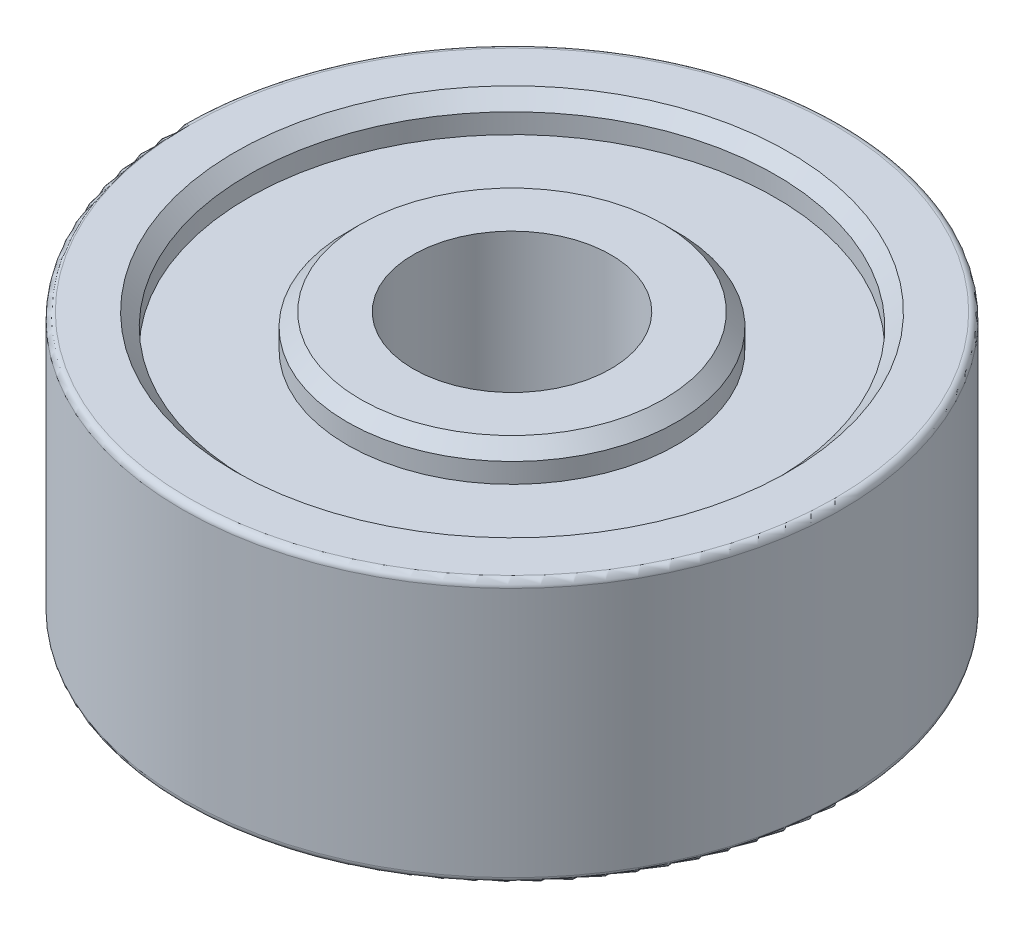
ISO-10303-21;
HEADER;
FILE_DESCRIPTION(('STEP AP214'),'2;1');
FILE_NAME('part.step','',(''),(''),'','','');
FILE_SCHEMA(('AUTOMOTIVE_DESIGN { 1 0 10303 214 1 1 1 1 }'));
ENDSEC;
DATA;
#1=APPLICATION_CONTEXT('core data for automotive mechanical design processes');
#2=APPLICATION_PROTOCOL_DEFINITION('international standard','automotive_design',2000,#1);
#3=PRODUCT_CONTEXT('',#1,'mechanical');
#4=PRODUCT('Part','Part','',(#3));
#5=PRODUCT_RELATED_PRODUCT_CATEGORY('part','',(#4));
#6=PRODUCT_DEFINITION_FORMATION('','',#4);
#7=PRODUCT_DEFINITION_CONTEXT('part definition',#1,'design');
#8=PRODUCT_DEFINITION('design','',#6,#7);
#9=PRODUCT_DEFINITION_SHAPE('','',#8);
#10=(LENGTH_UNIT() NAMED_UNIT(*) SI_UNIT(.MILLI.,.METRE.));
#11=(NAMED_UNIT(*) PLANE_ANGLE_UNIT() SI_UNIT($,.RADIAN.));
#12=(NAMED_UNIT(*) SI_UNIT($,.STERADIAN.) SOLID_ANGLE_UNIT());
#13=UNCERTAINTY_MEASURE_WITH_UNIT(LENGTH_MEASURE(1.E-05),#10,'distance_accuracy_value','');
#14=(GEOMETRIC_REPRESENTATION_CONTEXT(3) GLOBAL_UNCERTAINTY_ASSIGNED_CONTEXT((#13)) GLOBAL_UNIT_ASSIGNED_CONTEXT((#10,
#11,#12)) REPRESENTATION_CONTEXT('',''));
#15=CARTESIAN_POINT('',(0.,0.,0.));
#16=DIRECTION('',(0.,0.,1.));
#17=DIRECTION('',(1.,0.,0.));
#18=AXIS2_PLACEMENT_3D('',#15,#16,#17);
#19=CARTESIAN_POINT('',(0.,-2.,0.));
#20=DIRECTION('',(0.,1.,0.));
#21=DIRECTION('',(0.,0.,1.));
#22=AXIS2_PLACEMENT_3D('',#19,#20,#21);
#23=PLANE('',#22);
#24=CARTESIAN_POINT('',(0.,-2.,0.));
#25=DIRECTION('',(0.,1.,0.));
#26=DIRECTION('',(0.,0.,1.));
#27=AXIS2_PLACEMENT_3D('',#24,#25,#26);
#28=CIRCLE('',#27,2.3);
#29=CARTESIAN_POINT('',(0.,-2.,2.3));
#30=VERTEX_POINT('',#29);
#31=EDGE_CURVE('E65',#30,#30,#28,.F.);
#32=ORIENTED_EDGE('',*,*,#31,.T.);
#33=EDGE_LOOP('',(#32));
#34=FACE_BOUND('',#33,.T.);
#35=CARTESIAN_POINT('',(0.,-2.,0.));
#36=DIRECTION('',(0.,1.,0.));
#37=DIRECTION('',(0.,0.,1.));
#38=AXIS2_PLACEMENT_3D('',#35,#36,#37);
#39=CIRCLE('',#38,1.5);
#40=CARTESIAN_POINT('',(0.,-2.,1.5));
#41=VERTEX_POINT('',#40);
#42=EDGE_CURVE('E78',#41,#41,#39,.T.);
#43=ORIENTED_EDGE('',*,*,#42,.T.);
#44=EDGE_LOOP('',(#43));
#45=FACE_BOUND('',#44,.T.);
#46=ADVANCED_FACE('F33',(#34,#45),#23,.F.);
#47=CARTESIAN_POINT('',(0.,2.,0.));
#48=DIRECTION('',(0.,1.,0.));
#49=DIRECTION('',(0.,0.,1.));
#50=AXIS2_PLACEMENT_3D('',#47,#48,#49);
#51=PLANE('',#50);
#52=CARTESIAN_POINT('',(0.,2.,0.));
#53=DIRECTION('',(0.,1.,0.));
#54=DIRECTION('',(0.,0.,1.));
#55=AXIS2_PLACEMENT_3D('',#52,#53,#54);
#56=CIRCLE('',#55,2.3);
#57=CARTESIAN_POINT('',(0.,2.,2.3));
#58=VERTEX_POINT('',#57);
#59=EDGE_CURVE('E62',#58,#58,#56,.T.);
#60=ORIENTED_EDGE('',*,*,#59,.T.);
#61=EDGE_LOOP('',(#60));
#62=FACE_BOUND('',#61,.T.);
#63=CARTESIAN_POINT('',(0.,2.,0.));
#64=DIRECTION('',(0.,1.,0.));
#65=DIRECTION('',(0.,0.,1.));
#66=AXIS2_PLACEMENT_3D('',#63,#64,#65);
#67=CIRCLE('',#66,1.5);
#68=CARTESIAN_POINT('',(0.,2.,1.5));
#69=VERTEX_POINT('',#68);
#70=EDGE_CURVE('E77',#69,#69,#67,.T.);
#71=ORIENTED_EDGE('',*,*,#70,.F.);
#72=EDGE_LOOP('',(#71));
#73=FACE_BOUND('',#72,.T.);
#74=ADVANCED_FACE('F115',(#62,#73),#51,.T.);
#75=CARTESIAN_POINT('',(0.,2.,0.));
#76=DIRECTION('',(0.,1.,0.));
#77=DIRECTION('',(0.,0.,1.));
#78=AXIS2_PLACEMENT_3D('',#75,#76,#77);
#79=CIRCLE('',#78,4.9);
#80=CARTESIAN_POINT('',(0.,2.,4.9));
#81=VERTEX_POINT('',#80);
#82=EDGE_CURVE('E10',#81,#81,#79,.T.);
#83=ORIENTED_EDGE('',*,*,#82,.T.);
#84=EDGE_LOOP('',(#83));
#85=FACE_BOUND('',#84,.T.);
#86=CARTESIAN_POINT('',(0.,2.,0.));
#87=DIRECTION('',(0.,1.,0.));
#88=DIRECTION('',(0.,0.,1.));
#89=AXIS2_PLACEMENT_3D('',#86,#87,#88);
#90=CIRCLE('',#89,4.2);
#91=CARTESIAN_POINT('',(0.,2.,4.2));
#92=VERTEX_POINT('',#91);
#93=EDGE_CURVE('E53',#92,#92,#90,.F.);
#94=ORIENTED_EDGE('',*,*,#93,.T.);
#95=EDGE_LOOP('',(#94));
#96=FACE_BOUND('',#95,.T.);
#97=ADVANCED_FACE('F122',(#85,#96),#51,.T.);
#98=CARTESIAN_POINT('',(0.,-2.,0.));
#99=DIRECTION('',(0.,1.,0.));
#100=DIRECTION('',(0.,0.,1.));
#101=AXIS2_PLACEMENT_3D('',#98,#99,#100);
#102=CIRCLE('',#101,4.9);
#103=CARTESIAN_POINT('',(0.,-2.,4.9));
#104=VERTEX_POINT('',#103);
#105=EDGE_CURVE('E40',#104,#104,#102,.F.);
#106=ORIENTED_EDGE('',*,*,#105,.T.);
#107=EDGE_LOOP('',(#106));
#108=FACE_BOUND('',#107,.T.);
#109=CARTESIAN_POINT('',(0.,-2.,0.));
#110=DIRECTION('',(0.,1.,0.));
#111=DIRECTION('',(0.,0.,1.));
#112=AXIS2_PLACEMENT_3D('',#109,#110,#111);
#113=CIRCLE('',#112,4.2);
#114=CARTESIAN_POINT('',(0.,-2.,4.2));
#115=VERTEX_POINT('',#114);
#116=EDGE_CURVE('E74',#115,#115,#113,.T.);
#117=ORIENTED_EDGE('',*,*,#116,.T.);
#118=EDGE_LOOP('',(#117));
#119=FACE_BOUND('',#118,.T.);
#120=ADVANCED_FACE('F118',(#108,#119),#23,.F.);
#121=CARTESIAN_POINT('',(0.,2.,0.));
#122=DIRECTION('',(0.,-1.,0.));
#123=DIRECTION('',(0.,0.,-1.));
#124=AXIS2_PLACEMENT_3D('',#121,#122,#123);
#125=CYLINDRICAL_SURFACE('',#124,5.);
#126=CARTESIAN_POINT('',(0.,-1.9,0.));
#127=DIRECTION('',(0.,1.,0.));
#128=DIRECTION('',(0.,0.,1.));
#129=AXIS2_PLACEMENT_3D('',#126,#127,#128);
#130=CIRCLE('',#129,5.);
#131=CARTESIAN_POINT('',(0.,-1.9,5.));
#132=VERTEX_POINT('',#131);
#133=EDGE_CURVE('E44',#132,#132,#130,.T.);
#134=ORIENTED_EDGE('',*,*,#133,.T.);
#135=EDGE_LOOP('',(#134));
#136=FACE_BOUND('',#135,.T.);
#137=CARTESIAN_POINT('',(0.,1.9,0.));
#138=DIRECTION('',(0.,1.,0.));
#139=DIRECTION('',(0.,0.,1.));
#140=AXIS2_PLACEMENT_3D('',#137,#138,#139);
#141=CIRCLE('',#140,5.);
#142=CARTESIAN_POINT('',(0.,1.9,5.));
#143=VERTEX_POINT('',#142);
#144=EDGE_CURVE('E48',#143,#143,#141,.F.);
#145=ORIENTED_EDGE('',*,*,#144,.T.);
#146=EDGE_LOOP('',(#145));
#147=FACE_BOUND('',#146,.T.);
#148=ADVANCED_FACE('F128',(#136,#147),#125,.T.);
#149=CARTESIAN_POINT('',(0.,2.,0.));
#150=DIRECTION('',(0.,-1.,0.));
#151=DIRECTION('',(0.,0.,-1.));
#152=AXIS2_PLACEMENT_3D('',#149,#150,#151);
#153=CYLINDRICAL_SURFACE('',#152,1.5);
#154=ORIENTED_EDGE('',*,*,#70,.T.);
#155=EDGE_LOOP('',(#154));
#156=FACE_BOUND('',#155,.T.);
#157=ORIENTED_EDGE('',*,*,#42,.F.);
#158=EDGE_LOOP('',(#157));
#159=FACE_BOUND('',#158,.T.);
#160=ADVANCED_FACE('F133',(#156,#159),#153,.F.);
#161=CARTESIAN_POINT('',(0.,1.5,0.));
#162=DIRECTION('',(0.,1.,0.));
#163=DIRECTION('',(0.,0.,1.));
#164=AXIS2_PLACEMENT_3D('',#161,#162,#163);
#165=CYLINDRICAL_SURFACE('',#164,4.);
#166=CARTESIAN_POINT('',(0.,1.8,0.));
#167=DIRECTION('',(0.,1.,0.));
#168=DIRECTION('',(0.,0.,1.));
#169=AXIS2_PLACEMENT_3D('',#166,#167,#168);
#170=CIRCLE('',#169,4.);
#171=CARTESIAN_POINT('',(0.,1.8,4.));
#172=VERTEX_POINT('',#171);
#173=EDGE_CURVE('E56',#172,#172,#170,.T.);
#174=ORIENTED_EDGE('',*,*,#173,.T.);
#175=EDGE_LOOP('',(#174));
#176=FACE_BOUND('',#175,.T.);
#177=CARTESIAN_POINT('',(0.,1.5,0.));
#178=DIRECTION('',(0.,1.,0.));
#179=DIRECTION('',(0.,0.,1.));
#180=AXIS2_PLACEMENT_3D('',#177,#178,#179);
#181=CIRCLE('',#180,4.);
#182=CARTESIAN_POINT('',(0.,1.5,4.));
#183=VERTEX_POINT('',#182);
#184=EDGE_CURVE('E81',#183,#183,#181,.T.);
#185=ORIENTED_EDGE('',*,*,#184,.F.);
#186=EDGE_LOOP('',(#185));
#187=FACE_BOUND('',#186,.T.);
#188=ADVANCED_FACE('F144',(#176,#187),#165,.F.);
#189=CARTESIAN_POINT('',(0.,1.5,0.));
#190=DIRECTION('',(0.,1.,0.));
#191=DIRECTION('',(0.,0.,1.));
#192=AXIS2_PLACEMENT_3D('',#189,#190,#191);
#193=PLANE('',#192);
#194=CARTESIAN_POINT('',(0.,1.5,0.));
#195=DIRECTION('',(0.,1.,0.));
#196=DIRECTION('',(0.,0.,1.));
#197=AXIS2_PLACEMENT_3D('',#194,#195,#196);
#198=CIRCLE('',#197,2.5);
#199=CARTESIAN_POINT('',(0.,1.5,2.5));
#200=VERTEX_POINT('',#199);
#201=EDGE_CURVE('E86',#200,#200,#198,.T.);
#202=ORIENTED_EDGE('',*,*,#201,.F.);
#203=EDGE_LOOP('',(#202));
#204=FACE_BOUND('',#203,.T.);
#205=ORIENTED_EDGE('',*,*,#184,.T.);
#206=EDGE_LOOP('',(#205));
#207=FACE_BOUND('',#206,.T.);
#208=ADVANCED_FACE('F148',(#204,#207),#193,.T.);
#209=CARTESIAN_POINT('',(0.,1.5,0.));
#210=DIRECTION('',(0.,1.,0.));
#211=DIRECTION('',(0.,0.,1.));
#212=AXIS2_PLACEMENT_3D('',#209,#210,#211);
#213=CYLINDRICAL_SURFACE('',#212,2.5);
#214=CARTESIAN_POINT('',(0.,1.8,0.));
#215=DIRECTION('',(0.,1.,0.));
#216=DIRECTION('',(0.,0.,1.));
#217=AXIS2_PLACEMENT_3D('',#214,#215,#216);
#218=CIRCLE('',#217,2.5);
#219=CARTESIAN_POINT('',(0.,1.8,2.5));
#220=VERTEX_POINT('',#219);
#221=EDGE_CURVE('E59',#220,#220,#218,.F.);
#222=ORIENTED_EDGE('',*,*,#221,.T.);
#223=EDGE_LOOP('',(#222));
#224=FACE_BOUND('',#223,.T.);
#225=ORIENTED_EDGE('',*,*,#201,.T.);
#226=EDGE_LOOP('',(#225));
#227=FACE_BOUND('',#226,.T.);
#228=ADVANCED_FACE('F152',(#224,#227),#213,.T.);
#229=CARTESIAN_POINT('',(0.,-1.5,0.));
#230=DIRECTION('',(0.,-1.,0.));
#231=DIRECTION('',(0.,0.,1.));
#232=AXIS2_PLACEMENT_3D('',#229,#230,#231);
#233=PLANE('',#232);
#234=CARTESIAN_POINT('',(0.,-1.5,0.));
#235=DIRECTION('',(0.,1.,0.));
#236=DIRECTION('',(0.,0.,1.));
#237=AXIS2_PLACEMENT_3D('',#234,#235,#236);
#238=CIRCLE('',#237,4.);
#239=CARTESIAN_POINT('',(0.,-1.5,4.));
#240=VERTEX_POINT('',#239);
#241=EDGE_CURVE('E89',#240,#240,#238,.T.);
#242=ORIENTED_EDGE('',*,*,#241,.F.);
#243=EDGE_LOOP('',(#242));
#244=FACE_BOUND('',#243,.T.);
#245=CARTESIAN_POINT('',(0.,-1.5,0.));
#246=DIRECTION('',(0.,1.,0.));
#247=DIRECTION('',(0.,0.,1.));
#248=AXIS2_PLACEMENT_3D('',#245,#246,#247);
#249=CIRCLE('',#248,2.5);
#250=CARTESIAN_POINT('',(0.,-1.5,2.5));
#251=VERTEX_POINT('',#250);
#252=EDGE_CURVE('E92',#251,#251,#249,.T.);
#253=ORIENTED_EDGE('',*,*,#252,.T.);
#254=EDGE_LOOP('',(#253));
#255=FACE_BOUND('',#254,.T.);
#256=ADVANCED_FACE('F96',(#244,#255),#233,.T.);
#257=CARTESIAN_POINT('',(0.,-1.5,0.));
#258=DIRECTION('',(0.,-1.,0.));
#259=DIRECTION('',(0.,0.,-1.));
#260=AXIS2_PLACEMENT_3D('',#257,#258,#259);
#261=CYLINDRICAL_SURFACE('',#260,4.);
#262=CARTESIAN_POINT('',(0.,-1.8,0.));
#263=DIRECTION('',(0.,1.,0.));
#264=DIRECTION('',(0.,0.,1.));
#265=AXIS2_PLACEMENT_3D('',#262,#263,#264);
#266=CIRCLE('',#265,4.);
#267=CARTESIAN_POINT('',(0.,-1.8,4.));
#268=VERTEX_POINT('',#267);
#269=EDGE_CURVE('E71',#268,#268,#266,.F.);
#270=ORIENTED_EDGE('',*,*,#269,.T.);
#271=EDGE_LOOP('',(#270));
#272=FACE_BOUND('',#271,.T.);
#273=ORIENTED_EDGE('',*,*,#241,.T.);
#274=EDGE_LOOP('',(#273));
#275=FACE_BOUND('',#274,.T.);
#276=ADVANCED_FACE('F101',(#272,#275),#261,.F.);
#277=CARTESIAN_POINT('',(0.,-1.5,0.));
#278=DIRECTION('',(0.,-1.,0.));
#279=DIRECTION('',(0.,0.,-1.));
#280=AXIS2_PLACEMENT_3D('',#277,#278,#279);
#281=CYLINDRICAL_SURFACE('',#280,2.5);
#282=CARTESIAN_POINT('',(0.,-1.8,0.));
#283=DIRECTION('',(0.,1.,0.));
#284=DIRECTION('',(0.,0.,1.));
#285=AXIS2_PLACEMENT_3D('',#282,#283,#284);
#286=CIRCLE('',#285,2.5);
#287=CARTESIAN_POINT('',(0.,-1.8,2.5));
#288=VERTEX_POINT('',#287);
#289=EDGE_CURVE('E68',#288,#288,#286,.T.);
#290=ORIENTED_EDGE('',*,*,#289,.T.);
#291=EDGE_LOOP('',(#290));
#292=FACE_BOUND('',#291,.T.);
#293=ORIENTED_EDGE('',*,*,#252,.F.);
#294=EDGE_LOOP('',(#293));
#295=FACE_BOUND('',#294,.T.);
#296=ADVANCED_FACE('F98',(#292,#295),#281,.T.);
#297=CARTESIAN_POINT('',(0.,-2.,0.));
#298=DIRECTION('',(0.,-1.,0.));
#299=DIRECTION('',(0.,0.,-1.));
#300=AXIS2_PLACEMENT_3D('',#297,#298,#299);
#301=CONICAL_SURFACE('',#300,4.2,0.785398163397442);
#302=ORIENTED_EDGE('',*,*,#269,.F.);
#303=EDGE_LOOP('',(#302));
#304=FACE_BOUND('',#303,.T.);
#305=ORIENTED_EDGE('',*,*,#116,.F.);
#306=EDGE_LOOP('',(#305));
#307=FACE_BOUND('',#306,.T.);
#308=ADVANCED_FACE('F100',(#304,#307),#301,.F.);
#309=CARTESIAN_POINT('',(0.,-1.8,0.));
#310=DIRECTION('',(0.,1.,0.));
#311=DIRECTION('',(0.,0.,1.));
#312=AXIS2_PLACEMENT_3D('',#309,#310,#311);
#313=CONICAL_SURFACE('',#312,2.5,0.785398163397451);
#314=ORIENTED_EDGE('',*,*,#31,.F.);
#315=EDGE_LOOP('',(#314));
#316=FACE_BOUND('',#315,.T.);
#317=ORIENTED_EDGE('',*,*,#289,.F.);
#318=EDGE_LOOP('',(#317));
#319=FACE_BOUND('',#318,.T.);
#320=ADVANCED_FACE('F108',(#316,#319),#313,.T.);
#321=CARTESIAN_POINT('',(0.,2.,0.));
#322=DIRECTION('',(0.,-1.,0.));
#323=DIRECTION('',(0.,0.,-1.));
#324=AXIS2_PLACEMENT_3D('',#321,#322,#323);
#325=CONICAL_SURFACE('',#324,2.3,0.785398163397445);
#326=ORIENTED_EDGE('',*,*,#221,.F.);
#327=EDGE_LOOP('',(#326));
#328=FACE_BOUND('',#327,.T.);
#329=ORIENTED_EDGE('',*,*,#59,.F.);
#330=EDGE_LOOP('',(#329));
#331=FACE_BOUND('',#330,.T.);
#332=ADVANCED_FACE('F191',(#328,#331),#325,.T.);
#333=CARTESIAN_POINT('',(0.,1.8,0.));
#334=DIRECTION('',(0.,1.,0.));
#335=DIRECTION('',(0.,0.,1.));
#336=AXIS2_PLACEMENT_3D('',#333,#334,#335);
#337=CONICAL_SURFACE('',#336,4.,0.78539816339745);
#338=ORIENTED_EDGE('',*,*,#93,.F.);
#339=EDGE_LOOP('',(#338));
#340=FACE_BOUND('',#339,.T.);
#341=ORIENTED_EDGE('',*,*,#173,.F.);
#342=EDGE_LOOP('',(#341));
#343=FACE_BOUND('',#342,.T.);
#344=ADVANCED_FACE('F201',(#340,#343),#337,.F.);
#345=CARTESIAN_POINT('',(0.,-1.9,0.));
#346=DIRECTION('',(0.,1.,0.));
#347=DIRECTION('',(0.,0.,1.));
#348=AXIS2_PLACEMENT_3D('',#345,#346,#347);
#349=TOROIDAL_SURFACE('',#348,4.9,0.1);
#350=ORIENTED_EDGE('',*,*,#105,.F.);
#351=EDGE_LOOP('',(#350));
#352=FACE_BOUND('',#351,.T.);
#353=ORIENTED_EDGE('',*,*,#133,.F.);
#354=EDGE_LOOP('',(#353));
#355=FACE_BOUND('',#354,.T.);
#356=ADVANCED_FACE('F210',(#352,#355),#349,.T.);
#357=CARTESIAN_POINT('',(0.,1.9,0.));
#358=DIRECTION('',(0.,1.,0.));
#359=DIRECTION('',(0.,0.,1.));
#360=AXIS2_PLACEMENT_3D('',#357,#358,#359);
#361=TOROIDAL_SURFACE('',#360,4.9,0.1);
#362=ORIENTED_EDGE('',*,*,#144,.F.);
#363=EDGE_LOOP('',(#362));
#364=FACE_BOUND('',#363,.T.);
#365=ORIENTED_EDGE('',*,*,#82,.F.);
#366=EDGE_LOOP('',(#365));
#367=FACE_BOUND('',#366,.T.);
#368=ADVANCED_FACE('F35',(#364,#367),#361,.T.);
#369=CLOSED_SHELL('',(#46,#74,#97,#120,#148,#160,#188,#208,#228,#256,#276,#296,#308,#320,#332,
#344,#356,#368));
#370=MANIFOLD_SOLID_BREP('B2',#369);
#371=ADVANCED_BREP_SHAPE_REPRESENTATION('',(#18,#370),#14);
#372=SHAPE_DEFINITION_REPRESENTATION(#9,#371);
ENDSEC;
END-ISO-10303-21;
